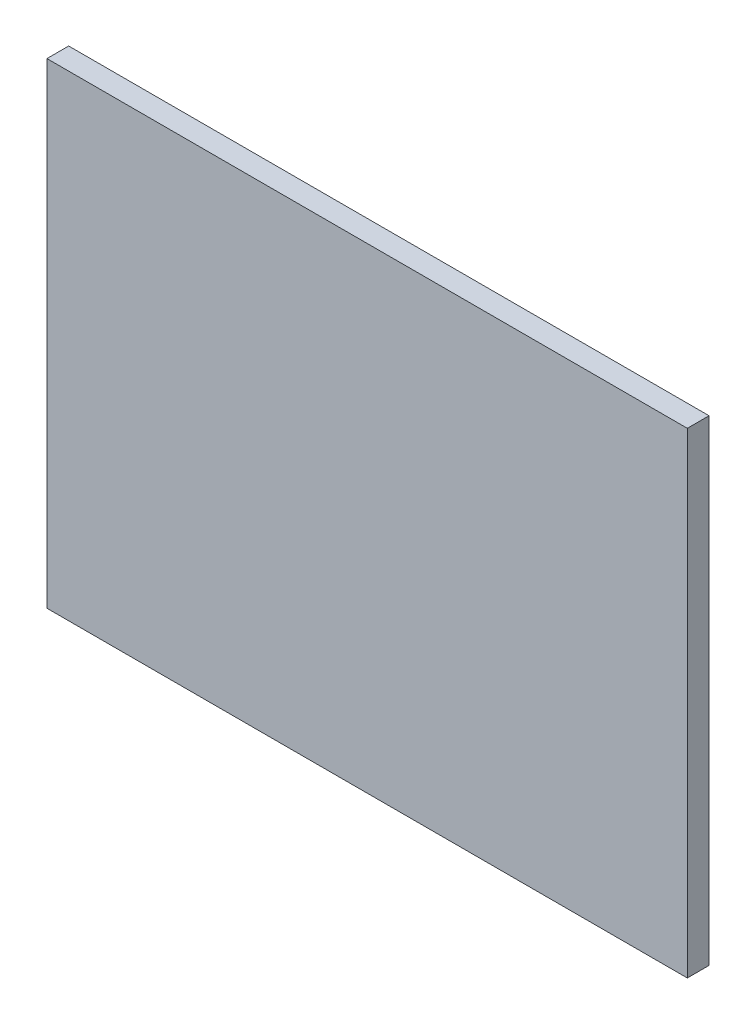
ISO-10303-21;
HEADER;
FILE_DESCRIPTION(('STEP AP214'),'2;1');
FILE_NAME('part.step','',(''),(''),'','','');
FILE_SCHEMA(('AUTOMOTIVE_DESIGN { 1 0 10303 214 1 1 1 1 }'));
ENDSEC;
DATA;
#1=APPLICATION_CONTEXT('core data for automotive mechanical design processes');
#2=APPLICATION_PROTOCOL_DEFINITION('international standard','automotive_design',2000,#1);
#3=PRODUCT_CONTEXT('',#1,'mechanical');
#4=PRODUCT('Part','Part','',(#3));
#5=PRODUCT_RELATED_PRODUCT_CATEGORY('part','',(#4));
#6=PRODUCT_DEFINITION_FORMATION('','',#4);
#7=PRODUCT_DEFINITION_CONTEXT('part definition',#1,'design');
#8=PRODUCT_DEFINITION('design','',#6,#7);
#9=PRODUCT_DEFINITION_SHAPE('','',#8);
#10=(LENGTH_UNIT() NAMED_UNIT(*) SI_UNIT(.MILLI.,.METRE.));
#11=(NAMED_UNIT(*) PLANE_ANGLE_UNIT() SI_UNIT($,.RADIAN.));
#12=(NAMED_UNIT(*) SI_UNIT($,.STERADIAN.) SOLID_ANGLE_UNIT());
#13=UNCERTAINTY_MEASURE_WITH_UNIT(LENGTH_MEASURE(1.E-05),#10,'distance_accuracy_value','');
#14=(GEOMETRIC_REPRESENTATION_CONTEXT(3) GLOBAL_UNCERTAINTY_ASSIGNED_CONTEXT((#13)) GLOBAL_UNIT_ASSIGNED_CONTEXT((#10,
#11,#12)) REPRESENTATION_CONTEXT('',''));
#15=CARTESIAN_POINT('',(0.,0.,0.));
#16=DIRECTION('',(0.,0.,1.));
#17=DIRECTION('',(1.,0.,0.));
#18=AXIS2_PLACEMENT_3D('',#15,#16,#17);
#19=CARTESIAN_POINT('',(265.,197.,18.));
#20=DIRECTION('',(-1.,0.,0.));
#21=DIRECTION('',(0.,-1.,0.));
#22=AXIS2_PLACEMENT_3D('',#19,#20,#21);
#23=PLANE('',#22);
#24=DIRECTION('',(0.,1.,0.));
#25=VECTOR('',#24,1.);
#26=CARTESIAN_POINT('',(265.,197.,0.));
#27=LINE('',#26,#25);
#28=CARTESIAN_POINT('',(265.,-197.,0.));
#29=VERTEX_POINT('',#28);
#30=CARTESIAN_POINT('',(265.,197.,0.));
#31=VERTEX_POINT('',#30);
#32=EDGE_CURVE('E95',#29,#31,#27,.T.);
#33=ORIENTED_EDGE('',*,*,#32,.T.);
#34=DIRECTION('',(0.,0.,-1.));
#35=VECTOR('',#34,1.);
#36=CARTESIAN_POINT('',(265.,197.,18.));
#37=LINE('',#36,#35);
#38=CARTESIAN_POINT('',(265.,197.,18.));
#39=VERTEX_POINT('',#38);
#40=EDGE_CURVE('E11',#39,#31,#37,.T.);
#41=ORIENTED_EDGE('',*,*,#40,.F.);
#42=DIRECTION('',(0.,1.,0.));
#43=VECTOR('',#42,1.);
#44=CARTESIAN_POINT('',(265.,197.,18.));
#45=LINE('',#44,#43);
#46=CARTESIAN_POINT('',(265.,-197.,18.));
#47=VERTEX_POINT('',#46);
#48=EDGE_CURVE('E83',#47,#39,#45,.T.);
#49=ORIENTED_EDGE('',*,*,#48,.F.);
#50=DIRECTION('',(0.,0.,-1.));
#51=VECTOR('',#50,1.);
#52=CARTESIAN_POINT('',(265.,-197.,18.));
#53=LINE('',#52,#51);
#54=EDGE_CURVE('E91',#47,#29,#53,.T.);
#55=ORIENTED_EDGE('',*,*,#54,.T.);
#56=EDGE_LOOP('',(#33,#41,#49,#55));
#57=FACE_BOUND('',#56,.T.);
#58=ADVANCED_FACE('F32',(#57),#23,.F.);
#59=CARTESIAN_POINT('',(-265.,197.,18.));
#60=DIRECTION('',(0.,-1.,0.));
#61=DIRECTION('',(0.,0.,-1.));
#62=AXIS2_PLACEMENT_3D('',#59,#60,#61);
#63=PLANE('',#62);
#64=DIRECTION('',(-1.,0.,0.));
#65=VECTOR('',#64,1.);
#66=CARTESIAN_POINT('',(-265.,197.,0.));
#67=LINE('',#66,#65);
#68=CARTESIAN_POINT('',(-265.,197.,0.));
#69=VERTEX_POINT('',#68);
#70=EDGE_CURVE('E87',#31,#69,#67,.T.);
#71=ORIENTED_EDGE('',*,*,#70,.T.);
#72=DIRECTION('',(0.,0.,-1.));
#73=VECTOR('',#72,1.);
#74=CARTESIAN_POINT('',(-265.,197.,18.));
#75=LINE('',#74,#73);
#76=CARTESIAN_POINT('',(-265.,197.,18.));
#77=VERTEX_POINT('',#76);
#78=EDGE_CURVE('E40',#77,#69,#75,.T.);
#79=ORIENTED_EDGE('',*,*,#78,.F.);
#80=DIRECTION('',(-1.,0.,0.));
#81=VECTOR('',#80,1.);
#82=CARTESIAN_POINT('',(-265.,197.,18.));
#83=LINE('',#82,#81);
#84=EDGE_CURVE('E78',#39,#77,#83,.T.);
#85=ORIENTED_EDGE('',*,*,#84,.F.);
#86=ORIENTED_EDGE('',*,*,#40,.T.);
#87=EDGE_LOOP('',(#71,#79,#85,#86));
#88=FACE_BOUND('',#87,.T.);
#89=ADVANCED_FACE('F86',(#88),#63,.F.);
#90=CARTESIAN_POINT('',(-265.,197.,18.));
#91=DIRECTION('',(1.,0.,0.));
#92=DIRECTION('',(0.,1.,0.));
#93=AXIS2_PLACEMENT_3D('',#90,#91,#92);
#94=PLANE('',#93);
#95=DIRECTION('',(0.,-1.,0.));
#96=VECTOR('',#95,1.);
#97=CARTESIAN_POINT('',(-265.,197.,0.));
#98=LINE('',#97,#96);
#99=CARTESIAN_POINT('',(-265.,-197.,0.));
#100=VERTEX_POINT('',#99);
#101=EDGE_CURVE('E65',#69,#100,#98,.T.);
#102=ORIENTED_EDGE('',*,*,#101,.T.);
#103=DIRECTION('',(0.,0.,-1.));
#104=VECTOR('',#103,1.);
#105=CARTESIAN_POINT('',(-265.,-197.,18.));
#106=LINE('',#105,#104);
#107=CARTESIAN_POINT('',(-265.,-197.,18.));
#108=VERTEX_POINT('',#107);
#109=EDGE_CURVE('E88',#108,#100,#106,.T.);
#110=ORIENTED_EDGE('',*,*,#109,.F.);
#111=DIRECTION('',(0.,-1.,0.));
#112=VECTOR('',#111,1.);
#113=CARTESIAN_POINT('',(-265.,197.,18.));
#114=LINE('',#113,#112);
#115=EDGE_CURVE('E81',#77,#108,#114,.T.);
#116=ORIENTED_EDGE('',*,*,#115,.F.);
#117=ORIENTED_EDGE('',*,*,#78,.T.);
#118=EDGE_LOOP('',(#102,#110,#116,#117));
#119=FACE_BOUND('',#118,.T.);
#120=ADVANCED_FACE('F89',(#119),#94,.F.);
#121=CARTESIAN_POINT('',(-265.,-197.,18.));
#122=DIRECTION('',(0.,1.,0.));
#123=DIRECTION('',(0.,0.,1.));
#124=AXIS2_PLACEMENT_3D('',#121,#122,#123);
#125=PLANE('',#124);
#126=DIRECTION('',(1.,0.,0.));
#127=VECTOR('',#126,1.);
#128=CARTESIAN_POINT('',(-265.,-197.,0.));
#129=LINE('',#128,#127);
#130=EDGE_CURVE('E71',#100,#29,#129,.T.);
#131=ORIENTED_EDGE('',*,*,#130,.T.);
#132=ORIENTED_EDGE('',*,*,#54,.F.);
#133=DIRECTION('',(1.,0.,0.));
#134=VECTOR('',#133,1.);
#135=CARTESIAN_POINT('',(-265.,-197.,18.));
#136=LINE('',#135,#134);
#137=EDGE_CURVE('E48',#108,#47,#136,.T.);
#138=ORIENTED_EDGE('',*,*,#137,.F.);
#139=ORIENTED_EDGE('',*,*,#109,.T.);
#140=EDGE_LOOP('',(#131,#132,#138,#139));
#141=FACE_BOUND('',#140,.T.);
#142=ADVANCED_FACE('F102',(#141),#125,.F.);
#143=CARTESIAN_POINT('',(0.,0.,18.));
#144=DIRECTION('',(0.,0.,1.));
#145=DIRECTION('',(1.,0.,0.));
#146=AXIS2_PLACEMENT_3D('',#143,#144,#145);
#147=PLANE('',#146);
#148=ORIENTED_EDGE('',*,*,#48,.T.);
#149=ORIENTED_EDGE('',*,*,#84,.T.);
#150=ORIENTED_EDGE('',*,*,#115,.T.);
#151=ORIENTED_EDGE('',*,*,#137,.T.);
#152=EDGE_LOOP('',(#148,#149,#150,#151));
#153=FACE_BOUND('',#152,.T.);
#154=ADVANCED_FACE('F79',(#153),#147,.T.);
#155=CARTESIAN_POINT('',(0.,0.,0.));
#156=DIRECTION('',(0.,0.,1.));
#157=DIRECTION('',(1.,0.,0.));
#158=AXIS2_PLACEMENT_3D('',#155,#156,#157);
#159=PLANE('',#158);
#160=ORIENTED_EDGE('',*,*,#32,.F.);
#161=ORIENTED_EDGE('',*,*,#130,.F.);
#162=ORIENTED_EDGE('',*,*,#101,.F.);
#163=ORIENTED_EDGE('',*,*,#70,.F.);
#164=EDGE_LOOP('',(#160,#161,#162,#163));
#165=FACE_BOUND('',#164,.T.);
#166=ADVANCED_FACE('F105',(#165),#159,.F.);
#167=CLOSED_SHELL('',(#58,#89,#120,#142,#154,#166));
#168=MANIFOLD_SOLID_BREP('B2',#167);
#169=ADVANCED_BREP_SHAPE_REPRESENTATION('',(#18,#168),#14);
#170=SHAPE_DEFINITION_REPRESENTATION(#9,#169);
ENDSEC;
END-ISO-10303-21;
